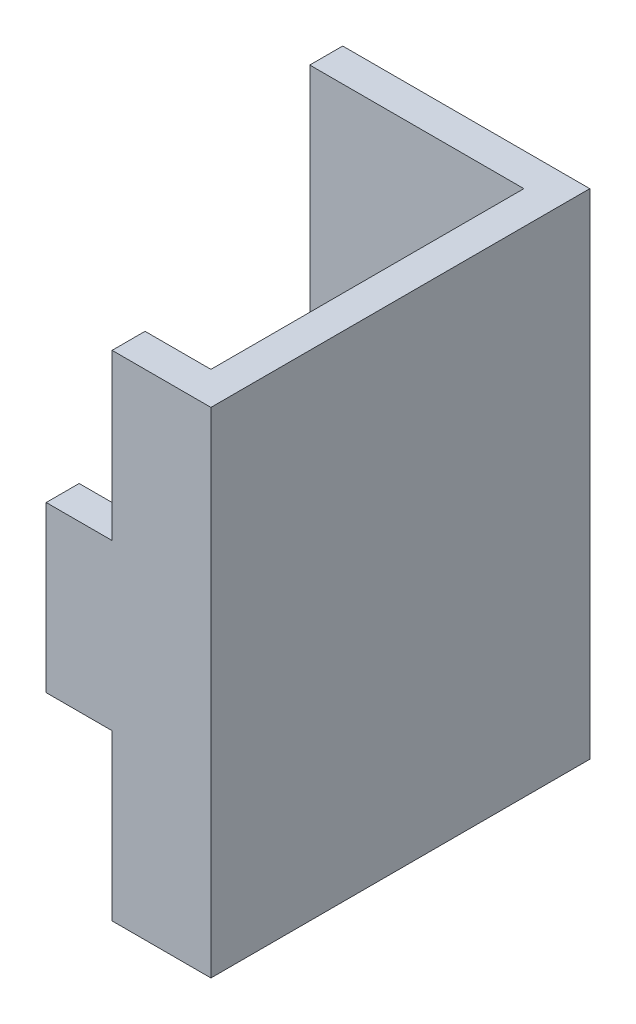
ISO-10303-21;
HEADER;
FILE_DESCRIPTION(('STEP AP214'),'2;1');
FILE_NAME('part.step','',(''),(''),'','','');
FILE_SCHEMA(('AUTOMOTIVE_DESIGN { 1 0 10303 214 1 1 1 1 }'));
ENDSEC;
DATA;
#1=APPLICATION_CONTEXT('core data for automotive mechanical design processes');
#2=APPLICATION_PROTOCOL_DEFINITION('international standard','automotive_design',2000,#1);
#3=PRODUCT_CONTEXT('',#1,'mechanical');
#4=PRODUCT('Part','Part','',(#3));
#5=PRODUCT_RELATED_PRODUCT_CATEGORY('part','',(#4));
#6=PRODUCT_DEFINITION_FORMATION('','',#4);
#7=PRODUCT_DEFINITION_CONTEXT('part definition',#1,'design');
#8=PRODUCT_DEFINITION('design','',#6,#7);
#9=PRODUCT_DEFINITION_SHAPE('','',#8);
#10=(LENGTH_UNIT() NAMED_UNIT(*) SI_UNIT(.MILLI.,.METRE.));
#11=(NAMED_UNIT(*) PLANE_ANGLE_UNIT() SI_UNIT($,.RADIAN.));
#12=(NAMED_UNIT(*) SI_UNIT($,.STERADIAN.) SOLID_ANGLE_UNIT());
#13=UNCERTAINTY_MEASURE_WITH_UNIT(LENGTH_MEASURE(1.E-05),#10,'distance_accuracy_value','');
#14=(GEOMETRIC_REPRESENTATION_CONTEXT(3) GLOBAL_UNCERTAINTY_ASSIGNED_CONTEXT((#13)) GLOBAL_UNIT_ASSIGNED_CONTEXT((#10,
#11,#12)) REPRESENTATION_CONTEXT('',''));
#15=CARTESIAN_POINT('',(0.,0.,0.));
#16=DIRECTION('',(0.,0.,1.));
#17=DIRECTION('',(1.,0.,0.));
#18=AXIS2_PLACEMENT_3D('',#15,#16,#17);
#19=CARTESIAN_POINT('',(8.25,2.458309395645,1.00916));
#20=DIRECTION('',(0.,0.,-1.));
#21=DIRECTION('',(-1.,0.,0.));
#22=AXIS2_PLACEMENT_3D('',#19,#20,#21);
#23=PLANE('',#22);
#24=DIRECTION('',(0.,1.,0.));
#25=VECTOR('',#24,1.);
#26=CARTESIAN_POINT('',(8.25,2.458309395645,1.00916));
#27=LINE('',#26,#25);
#28=CARTESIAN_POINT('',(8.25,2.7329,1.00916));
#29=VERTEX_POINT('',#28);
#30=CARTESIAN_POINT('',(8.25,3.0329,1.00916));
#31=VERTEX_POINT('',#30);
#32=EDGE_CURVE('E136',#29,#31,#27,.T.);
#33=ORIENTED_EDGE('',*,*,#32,.F.);
#34=DIRECTION('',(-1.,0.,0.));
#35=VECTOR('',#34,1.);
#36=CARTESIAN_POINT('',(8.25,2.7329,1.00916));
#37=LINE('',#36,#35);
#38=CARTESIAN_POINT('',(8.21,2.7329,1.00916));
#39=VERTEX_POINT('',#38);
#40=EDGE_CURVE('E144',#29,#39,#37,.T.);
#41=ORIENTED_EDGE('',*,*,#40,.T.);
#42=DIRECTION('',(0.,1.,0.));
#43=VECTOR('',#42,1.);
#44=CARTESIAN_POINT('',(8.21,2.7329,1.00916));
#45=LINE('',#44,#43);
#46=CARTESIAN_POINT('',(8.21,2.8329,1.00916));
#47=VERTEX_POINT('',#46);
#48=EDGE_CURVE('E116',#39,#47,#45,.T.);
#49=ORIENTED_EDGE('',*,*,#48,.T.);
#50=DIRECTION('',(-1.,0.,0.));
#51=VECTOR('',#50,1.);
#52=CARTESIAN_POINT('',(8.25,2.8329,1.00916));
#53=LINE('',#52,#51);
#54=CARTESIAN_POINT('',(8.17,2.8329,1.00916));
#55=VERTEX_POINT('',#54);
#56=EDGE_CURVE('E20',#47,#55,#53,.T.);
#57=ORIENTED_EDGE('',*,*,#56,.T.);
#58=DIRECTION('',(0.,1.,0.));
#59=VECTOR('',#58,1.);
#60=CARTESIAN_POINT('',(8.17,2.458309395645,1.00916));
#61=LINE('',#60,#59);
#62=CARTESIAN_POINT('',(8.17,2.9329,1.00916));
#63=VERTEX_POINT('',#62);
#64=EDGE_CURVE('E120',#63,#55,#61,.F.);
#65=ORIENTED_EDGE('',*,*,#64,.F.);
#66=DIRECTION('',(1.,0.,0.));
#67=VECTOR('',#66,1.);
#68=CARTESIAN_POINT('',(8.21,2.9329,1.00916));
#69=LINE('',#68,#67);
#70=CARTESIAN_POINT('',(8.21,2.9329,1.00916));
#71=VERTEX_POINT('',#70);
#72=EDGE_CURVE('E103',#63,#71,#69,.T.);
#73=ORIENTED_EDGE('',*,*,#72,.T.);
#74=DIRECTION('',(0.,1.,0.));
#75=VECTOR('',#74,1.);
#76=CARTESIAN_POINT('',(8.21,3.0329,1.00916));
#77=LINE('',#76,#75);
#78=CARTESIAN_POINT('',(8.21,3.0329,1.00916));
#79=VERTEX_POINT('',#78);
#80=EDGE_CURVE('E109',#71,#79,#77,.T.);
#81=ORIENTED_EDGE('',*,*,#80,.T.);
#82=DIRECTION('',(-1.,0.,0.));
#83=VECTOR('',#82,1.);
#84=CARTESIAN_POINT('',(8.25,3.0329,1.00916));
#85=LINE('',#84,#83);
#86=EDGE_CURVE('E145',#79,#31,#85,.F.);
#87=ORIENTED_EDGE('',*,*,#86,.T.);
#88=EDGE_LOOP('',(#33,#41,#49,#57,#65,#73,#81,#87));
#89=FACE_BOUND('',#88,.T.);
#90=ADVANCED_FACE('F17',(#89),#23,.T.);
#91=CARTESIAN_POINT('',(8.12,2.458309395645,0.79916));
#92=DIRECTION('',(-1.,0.,0.));
#93=DIRECTION('',(0.,0.,1.));
#94=AXIS2_PLACEMENT_3D('',#91,#92,#93);
#95=PLANE('',#94);
#96=DIRECTION('',(0.,0.,1.));
#97=VECTOR('',#96,1.);
#98=CARTESIAN_POINT('',(8.12,3.0329,0.79916));
#99=LINE('',#98,#97);
#100=CARTESIAN_POINT('',(8.12,3.0329,0.81916));
#101=VERTEX_POINT('',#100);
#102=CARTESIAN_POINT('',(8.12,3.0329,0.79916));
#103=VERTEX_POINT('',#102);
#104=EDGE_CURVE('E142',#101,#103,#99,.F.);
#105=ORIENTED_EDGE('',*,*,#104,.T.);
#106=DIRECTION('',(0.,1.,0.));
#107=VECTOR('',#106,1.);
#108=CARTESIAN_POINT('',(8.12,2.458309395645,0.79916));
#109=LINE('',#108,#107);
#110=CARTESIAN_POINT('',(8.12,2.7329,0.79916));
#111=VERTEX_POINT('',#110);
#112=EDGE_CURVE('E177',#111,#103,#109,.T.);
#113=ORIENTED_EDGE('',*,*,#112,.F.);
#114=DIRECTION('',(0.,0.,1.));
#115=VECTOR('',#114,1.);
#116=CARTESIAN_POINT('',(8.12,2.7329,1.00916));
#117=LINE('',#116,#115);
#118=CARTESIAN_POINT('',(8.12,2.7329,0.81916));
#119=VERTEX_POINT('',#118);
#120=EDGE_CURVE('E163',#111,#119,#117,.T.);
#121=ORIENTED_EDGE('',*,*,#120,.T.);
#122=DIRECTION('',(0.,-1.,0.));
#123=VECTOR('',#122,1.);
#124=CARTESIAN_POINT('',(8.12,2.458309395645,0.81916));
#125=LINE('',#124,#123);
#126=EDGE_CURVE('E139',#101,#119,#125,.T.);
#127=ORIENTED_EDGE('',*,*,#126,.F.);
#128=EDGE_LOOP('',(#105,#113,#121,#127));
#129=FACE_BOUND('',#128,.T.);
#130=ADVANCED_FACE('F219',(#129),#95,.T.);
#131=CARTESIAN_POINT('',(8.12,2.458309395645,0.81916));
#132=DIRECTION('',(0.,0.,1.));
#133=DIRECTION('',(0.,-1.,0.));
#134=AXIS2_PLACEMENT_3D('',#131,#132,#133);
#135=PLANE('',#134);
#136=DIRECTION('',(1.,0.,0.));
#137=VECTOR('',#136,1.);
#138=CARTESIAN_POINT('',(7.97,3.0329,0.81916));
#139=LINE('',#138,#137);
#140=CARTESIAN_POINT('',(8.25,3.0329,0.81916));
#141=VERTEX_POINT('',#140);
#142=EDGE_CURVE('E184',#101,#141,#139,.T.);
#143=ORIENTED_EDGE('',*,*,#142,.F.);
#144=ORIENTED_EDGE('',*,*,#126,.T.);
#145=DIRECTION('',(1.,0.,0.));
#146=VECTOR('',#145,1.);
#147=CARTESIAN_POINT('',(7.69,2.7329,0.81916));
#148=LINE('',#147,#146);
#149=CARTESIAN_POINT('',(8.25,2.7329,0.81916));
#150=VERTEX_POINT('',#149);
#151=EDGE_CURVE('E167',#119,#150,#148,.T.);
#152=ORIENTED_EDGE('',*,*,#151,.T.);
#153=DIRECTION('',(0.,1.,0.));
#154=VECTOR('',#153,1.);
#155=CARTESIAN_POINT('',(8.25,2.458309395645,0.81916));
#156=LINE('',#155,#154);
#157=EDGE_CURVE('E133',#141,#150,#156,.F.);
#158=ORIENTED_EDGE('',*,*,#157,.F.);
#159=EDGE_LOOP('',(#143,#144,#152,#158));
#160=FACE_BOUND('',#159,.T.);
#161=ADVANCED_FACE('F223',(#160),#135,.T.);
#162=CARTESIAN_POINT('',(8.25,2.458309395645,0.81916));
#163=DIRECTION('',(-1.,0.,0.));
#164=DIRECTION('',(0.,0.,1.));
#165=AXIS2_PLACEMENT_3D('',#162,#163,#164);
#166=PLANE('',#165);
#167=DIRECTION('',(0.,0.,1.));
#168=VECTOR('',#167,1.);
#169=CARTESIAN_POINT('',(8.25,3.0329,0.81916));
#170=LINE('',#169,#168);
#171=EDGE_CURVE('E187',#141,#31,#170,.T.);
#172=ORIENTED_EDGE('',*,*,#171,.F.);
#173=ORIENTED_EDGE('',*,*,#157,.T.);
#174=DIRECTION('',(0.,0.,1.));
#175=VECTOR('',#174,1.);
#176=CARTESIAN_POINT('',(8.25,2.7329,1.00916));
#177=LINE('',#176,#175);
#178=EDGE_CURVE('E169',#150,#29,#177,.T.);
#179=ORIENTED_EDGE('',*,*,#178,.T.);
#180=ORIENTED_EDGE('',*,*,#32,.T.);
#181=EDGE_LOOP('',(#172,#173,#179,#180));
#182=FACE_BOUND('',#181,.T.);
#183=ADVANCED_FACE('F226',(#182),#166,.T.);
#184=CARTESIAN_POINT('',(8.21,2.7329,0.901456703857));
#185=DIRECTION('',(1.,0.,0.));
#186=DIRECTION('',(0.,0.,-1.));
#187=AXIS2_PLACEMENT_3D('',#184,#185,#186);
#188=PLANE('',#187);
#189=DIRECTION('',(0.,0.,1.));
#190=VECTOR('',#189,1.);
#191=CARTESIAN_POINT('',(8.21,2.7329,1.00916));
#192=LINE('',#191,#190);
#193=CARTESIAN_POINT('',(8.21,2.7329,1.02916));
#194=VERTEX_POINT('',#193);
#195=EDGE_CURVE('E172',#39,#194,#192,.T.);
#196=ORIENTED_EDGE('',*,*,#195,.T.);
#197=DIRECTION('',(0.,-1.,0.));
#198=VECTOR('',#197,1.);
#199=CARTESIAN_POINT('',(8.21,2.458309395645,1.02916));
#200=LINE('',#199,#198);
#201=CARTESIAN_POINT('',(8.21,2.8329,1.02916));
#202=VERTEX_POINT('',#201);
#203=EDGE_CURVE('E190',#202,#194,#200,.T.);
#204=ORIENTED_EDGE('',*,*,#203,.F.);
#205=DIRECTION('',(0.,0.,1.));
#206=VECTOR('',#205,1.);
#207=CARTESIAN_POINT('',(8.21,2.8329,0.901456703857));
#208=LINE('',#207,#206);
#209=EDGE_CURVE('E161',#202,#47,#208,.F.);
#210=ORIENTED_EDGE('',*,*,#209,.T.);
#211=ORIENTED_EDGE('',*,*,#48,.F.);
#212=EDGE_LOOP('',(#196,#204,#210,#211));
#213=FACE_BOUND('',#212,.T.);
#214=ADVANCED_FACE('F231',(#213),#188,.F.);
#215=CARTESIAN_POINT('',(8.21,3.0329,0.901456703857));
#216=DIRECTION('',(1.,0.,0.));
#217=DIRECTION('',(0.,0.,-1.));
#218=AXIS2_PLACEMENT_3D('',#215,#216,#217);
#219=PLANE('',#218);
#220=DIRECTION('',(0.,0.,-1.));
#221=VECTOR('',#220,1.);
#222=CARTESIAN_POINT('',(8.21,2.9329,0.901456703857));
#223=LINE('',#222,#221);
#224=CARTESIAN_POINT('',(8.21,2.9329,1.02916));
#225=VERTEX_POINT('',#224);
#226=EDGE_CURVE('E112',#71,#225,#223,.F.);
#227=ORIENTED_EDGE('',*,*,#226,.T.);
#228=DIRECTION('',(0.,-1.,0.));
#229=VECTOR('',#228,1.);
#230=CARTESIAN_POINT('',(8.21,2.458309395645,1.02916));
#231=LINE('',#230,#229);
#232=CARTESIAN_POINT('',(8.21,3.0329,1.02916));
#233=VERTEX_POINT('',#232);
#234=EDGE_CURVE('E197',#233,#225,#231,.T.);
#235=ORIENTED_EDGE('',*,*,#234,.F.);
#236=DIRECTION('',(0.,0.,1.));
#237=VECTOR('',#236,1.);
#238=CARTESIAN_POINT('',(8.21,3.0329,0.81916));
#239=LINE('',#238,#237);
#240=EDGE_CURVE('E114',#79,#233,#239,.T.);
#241=ORIENTED_EDGE('',*,*,#240,.F.);
#242=ORIENTED_EDGE('',*,*,#80,.F.);
#243=EDGE_LOOP('',(#227,#235,#241,#242));
#244=FACE_BOUND('',#243,.T.);
#245=ADVANCED_FACE('F110',(#244),#219,.F.);
#246=CARTESIAN_POINT('',(8.21,2.9329,0.901456703857));
#247=DIRECTION('',(0.,-1.,0.));
#248=DIRECTION('',(0.,0.,-1.));
#249=AXIS2_PLACEMENT_3D('',#246,#247,#248);
#250=PLANE('',#249);
#251=DIRECTION('',(0.,0.,1.));
#252=VECTOR('',#251,1.);
#253=CARTESIAN_POINT('',(8.17,2.9329,1.00916));
#254=LINE('',#253,#252);
#255=CARTESIAN_POINT('',(8.17,2.9329,1.02916));
#256=VERTEX_POINT('',#255);
#257=EDGE_CURVE('E122',#256,#63,#254,.F.);
#258=ORIENTED_EDGE('',*,*,#257,.F.);
#259=DIRECTION('',(1.,0.,0.));
#260=VECTOR('',#259,1.);
#261=CARTESIAN_POINT('',(8.17,2.9329,1.02916));
#262=LINE('',#261,#260);
#263=EDGE_CURVE('E126',#225,#256,#262,.F.);
#264=ORIENTED_EDGE('',*,*,#263,.F.);
#265=ORIENTED_EDGE('',*,*,#226,.F.);
#266=ORIENTED_EDGE('',*,*,#72,.F.);
#267=EDGE_LOOP('',(#258,#264,#265,#266));
#268=FACE_BOUND('',#267,.T.);
#269=ADVANCED_FACE('F124',(#268),#250,.F.);
#270=CARTESIAN_POINT('',(8.17,2.458309395645,1.00916));
#271=DIRECTION('',(-1.,0.,0.));
#272=DIRECTION('',(0.,0.,1.));
#273=AXIS2_PLACEMENT_3D('',#270,#271,#272);
#274=PLANE('',#273);
#275=ORIENTED_EDGE('',*,*,#257,.T.);
#276=ORIENTED_EDGE('',*,*,#64,.T.);
#277=DIRECTION('',(0.,0.,1.));
#278=VECTOR('',#277,1.);
#279=CARTESIAN_POINT('',(8.17,2.8329,0.901456703857));
#280=LINE('',#279,#278);
#281=CARTESIAN_POINT('',(8.17,2.8329,1.02916));
#282=VERTEX_POINT('',#281);
#283=EDGE_CURVE('E154',#55,#282,#280,.T.);
#284=ORIENTED_EDGE('',*,*,#283,.T.);
#285=DIRECTION('',(0.,-1.,0.));
#286=VECTOR('',#285,1.);
#287=CARTESIAN_POINT('',(8.17,2.458309395645,1.02916));
#288=LINE('',#287,#286);
#289=EDGE_CURVE('E200',#256,#282,#288,.T.);
#290=ORIENTED_EDGE('',*,*,#289,.F.);
#291=EDGE_LOOP('',(#275,#276,#284,#290));
#292=FACE_BOUND('',#291,.T.);
#293=ADVANCED_FACE('F152',(#292),#274,.T.);
#294=CARTESIAN_POINT('',(8.21,2.8329,0.901456703857));
#295=DIRECTION('',(0.,1.,0.));
#296=DIRECTION('',(0.,0.,1.));
#297=AXIS2_PLACEMENT_3D('',#294,#295,#296);
#298=PLANE('',#297);
#299=ORIENTED_EDGE('',*,*,#209,.F.);
#300=DIRECTION('',(1.,0.,0.));
#301=VECTOR('',#300,1.);
#302=CARTESIAN_POINT('',(8.17,2.8329,1.02916));
#303=LINE('',#302,#301);
#304=EDGE_CURVE('E159',#282,#202,#303,.T.);
#305=ORIENTED_EDGE('',*,*,#304,.F.);
#306=ORIENTED_EDGE('',*,*,#283,.F.);
#307=ORIENTED_EDGE('',*,*,#56,.F.);
#308=EDGE_LOOP('',(#299,#305,#306,#307));
#309=FACE_BOUND('',#308,.T.);
#310=ADVANCED_FACE('F157',(#309),#298,.F.);
#311=CARTESIAN_POINT('',(7.69,2.7329,1.00916));
#312=DIRECTION('',(0.,1.,0.));
#313=DIRECTION('',(0.,0.,1.));
#314=AXIS2_PLACEMENT_3D('',#311,#312,#313);
#315=PLANE('',#314);
#316=ORIENTED_EDGE('',*,*,#195,.F.);
#317=ORIENTED_EDGE('',*,*,#40,.F.);
#318=ORIENTED_EDGE('',*,*,#178,.F.);
#319=ORIENTED_EDGE('',*,*,#151,.F.);
#320=ORIENTED_EDGE('',*,*,#120,.F.);
#321=DIRECTION('',(-1.,0.,0.));
#322=VECTOR('',#321,1.);
#323=CARTESIAN_POINT('',(8.27,2.7329,0.79916));
#324=LINE('',#323,#322);
#325=CARTESIAN_POINT('',(8.27,2.7329,0.79916));
#326=VERTEX_POINT('',#325);
#327=EDGE_CURVE('E174',#326,#111,#324,.T.);
#328=ORIENTED_EDGE('',*,*,#327,.F.);
#329=DIRECTION('',(0.,0.,-1.));
#330=VECTOR('',#329,1.);
#331=CARTESIAN_POINT('',(8.27,2.7329,1.02916));
#332=LINE('',#331,#330);
#333=CARTESIAN_POINT('',(8.27,2.7329,1.02916));
#334=VERTEX_POINT('',#333);
#335=EDGE_CURVE('E203',#334,#326,#332,.T.);
#336=ORIENTED_EDGE('',*,*,#335,.F.);
#337=DIRECTION('',(1.,0.,0.));
#338=VECTOR('',#337,1.);
#339=CARTESIAN_POINT('',(8.17,2.7329,1.02916));
#340=LINE('',#339,#338);
#341=EDGE_CURVE('E193',#194,#334,#340,.T.);
#342=ORIENTED_EDGE('',*,*,#341,.F.);
#343=EDGE_LOOP('',(#316,#317,#318,#319,#320,#328,#336,#342));
#344=FACE_BOUND('',#343,.T.);
#345=ADVANCED_FACE('F233',(#344),#315,.F.);
#346=CARTESIAN_POINT('',(8.27,2.458309395645,0.79916));
#347=DIRECTION('',(0.,0.,-1.));
#348=DIRECTION('',(-1.,0.,0.));
#349=AXIS2_PLACEMENT_3D('',#346,#347,#348);
#350=PLANE('',#349);
#351=DIRECTION('',(1.,0.,0.));
#352=VECTOR('',#351,1.);
#353=CARTESIAN_POINT('',(7.97,3.0329,0.79916));
#354=LINE('',#353,#352);
#355=CARTESIAN_POINT('',(8.27,3.0329,0.79916));
#356=VERTEX_POINT('',#355);
#357=EDGE_CURVE('E181',#356,#103,#354,.F.);
#358=ORIENTED_EDGE('',*,*,#357,.F.);
#359=DIRECTION('',(0.,1.,0.));
#360=VECTOR('',#359,1.);
#361=CARTESIAN_POINT('',(8.27,2.458309395645,0.79916));
#362=LINE('',#361,#360);
#363=EDGE_CURVE('E206',#326,#356,#362,.T.);
#364=ORIENTED_EDGE('',*,*,#363,.F.);
#365=ORIENTED_EDGE('',*,*,#327,.T.);
#366=ORIENTED_EDGE('',*,*,#112,.T.);
#367=EDGE_LOOP('',(#358,#364,#365,#366));
#368=FACE_BOUND('',#367,.T.);
#369=ADVANCED_FACE('F216',(#368),#350,.T.);
#370=CARTESIAN_POINT('',(7.97,3.0329,0.81916));
#371=DIRECTION('',(0.,1.,0.));
#372=DIRECTION('',(0.,0.,1.));
#373=AXIS2_PLACEMENT_3D('',#370,#371,#372);
#374=PLANE('',#373);
#375=ORIENTED_EDGE('',*,*,#171,.T.);
#376=ORIENTED_EDGE('',*,*,#86,.F.);
#377=ORIENTED_EDGE('',*,*,#240,.T.);
#378=DIRECTION('',(1.,0.,0.));
#379=VECTOR('',#378,1.);
#380=CARTESIAN_POINT('',(8.17,3.0329,1.02916));
#381=LINE('',#380,#379);
#382=CARTESIAN_POINT('',(8.27,3.0329,1.02916));
#383=VERTEX_POINT('',#382);
#384=EDGE_CURVE('E35',#383,#233,#381,.F.);
#385=ORIENTED_EDGE('',*,*,#384,.F.);
#386=DIRECTION('',(0.,0.,-1.));
#387=VECTOR('',#386,1.);
#388=CARTESIAN_POINT('',(8.27,3.0329,1.02916));
#389=LINE('',#388,#387);
#390=EDGE_CURVE('E26',#356,#383,#389,.F.);
#391=ORIENTED_EDGE('',*,*,#390,.F.);
#392=ORIENTED_EDGE('',*,*,#357,.T.);
#393=ORIENTED_EDGE('',*,*,#104,.F.);
#394=ORIENTED_EDGE('',*,*,#142,.T.);
#395=EDGE_LOOP('',(#375,#376,#377,#385,#391,#392,#393,#394));
#396=FACE_BOUND('',#395,.T.);
#397=ADVANCED_FACE('F213',(#396),#374,.T.);
#398=CARTESIAN_POINT('',(8.17,2.458309395645,1.02916));
#399=DIRECTION('',(0.,0.,1.));
#400=DIRECTION('',(0.,-1.,0.));
#401=AXIS2_PLACEMENT_3D('',#398,#399,#400);
#402=PLANE('',#401);
#403=ORIENTED_EDGE('',*,*,#289,.T.);
#404=ORIENTED_EDGE('',*,*,#304,.T.);
#405=ORIENTED_EDGE('',*,*,#203,.T.);
#406=ORIENTED_EDGE('',*,*,#341,.T.);
#407=DIRECTION('',(0.,1.,0.));
#408=VECTOR('',#407,1.);
#409=CARTESIAN_POINT('',(8.27,2.458309395645,1.02916));
#410=LINE('',#409,#408);
#411=EDGE_CURVE('E11',#383,#334,#410,.F.);
#412=ORIENTED_EDGE('',*,*,#411,.F.);
#413=ORIENTED_EDGE('',*,*,#384,.T.);
#414=ORIENTED_EDGE('',*,*,#234,.T.);
#415=ORIENTED_EDGE('',*,*,#263,.T.);
#416=EDGE_LOOP('',(#403,#404,#405,#406,#412,#413,#414,#415));
#417=FACE_BOUND('',#416,.T.);
#418=ADVANCED_FACE('F235',(#417),#402,.T.);
#419=CARTESIAN_POINT('',(8.27,2.458309395645,1.02916));
#420=DIRECTION('',(1.,0.,0.));
#421=DIRECTION('',(0.,0.,-1.));
#422=AXIS2_PLACEMENT_3D('',#419,#420,#421);
#423=PLANE('',#422);
#424=ORIENTED_EDGE('',*,*,#390,.T.);
#425=ORIENTED_EDGE('',*,*,#411,.T.);
#426=ORIENTED_EDGE('',*,*,#335,.T.);
#427=ORIENTED_EDGE('',*,*,#363,.T.);
#428=EDGE_LOOP('',(#424,#425,#426,#427));
#429=FACE_BOUND('',#428,.T.);
#430=ADVANCED_FACE('F211',(#429),#423,.T.);
#431=CLOSED_SHELL('',(#90,#130,#161,#183,#214,#245,#269,#293,#310,#345,#369,#397,#418,#430));
#432=MANIFOLD_SOLID_BREP('B1',#431);
#433=ADVANCED_BREP_SHAPE_REPRESENTATION('',(#18,#432),#14);
#434=SHAPE_DEFINITION_REPRESENTATION(#9,#433);
ENDSEC;
END-ISO-10303-21;
